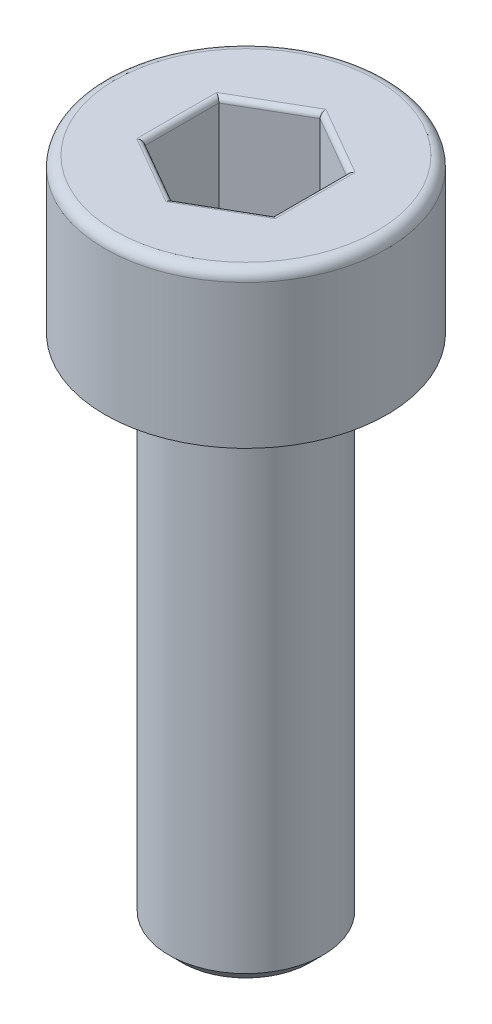
ISO-10303-21;
HEADER;
FILE_DESCRIPTION(('STEP AP214'),'2;1');
FILE_NAME('part.step','',(''),(''),'','','');
FILE_SCHEMA(('AUTOMOTIVE_DESIGN { 1 0 10303 214 1 1 1 1 }'));
ENDSEC;
DATA;
#1=APPLICATION_CONTEXT('core data for automotive mechanical design processes');
#2=APPLICATION_PROTOCOL_DEFINITION('international standard','automotive_design',2000,#1);
#3=PRODUCT_CONTEXT('',#1,'mechanical');
#4=PRODUCT('Part','Part','',(#3));
#5=PRODUCT_RELATED_PRODUCT_CATEGORY('part','',(#4));
#6=PRODUCT_DEFINITION_FORMATION('','',#4);
#7=PRODUCT_DEFINITION_CONTEXT('part definition',#1,'design');
#8=PRODUCT_DEFINITION('design','',#6,#7);
#9=PRODUCT_DEFINITION_SHAPE('','',#8);
#10=(LENGTH_UNIT() NAMED_UNIT(*) SI_UNIT(.MILLI.,.METRE.));
#11=(NAMED_UNIT(*) PLANE_ANGLE_UNIT() SI_UNIT($,.RADIAN.));
#12=(NAMED_UNIT(*) SI_UNIT($,.STERADIAN.) SOLID_ANGLE_UNIT());
#13=UNCERTAINTY_MEASURE_WITH_UNIT(LENGTH_MEASURE(1.E-05),#10,'distance_accuracy_value','');
#14=(GEOMETRIC_REPRESENTATION_CONTEXT(3) GLOBAL_UNCERTAINTY_ASSIGNED_CONTEXT((#13)) GLOBAL_UNIT_ASSIGNED_CONTEXT((#10,
#11,#12)) REPRESENTATION_CONTEXT('',''));
#15=CARTESIAN_POINT('',(0.,0.,0.));
#16=DIRECTION('',(0.,0.,1.));
#17=DIRECTION('',(1.,0.,0.));
#18=AXIS2_PLACEMENT_3D('',#15,#16,#17);
#19=CARTESIAN_POINT('',(0.,-13.,0.));
#20=DIRECTION('',(0.,-1.,0.));
#21=DIRECTION('',(0.,0.,-1.));
#22=AXIS2_PLACEMENT_3D('',#19,#20,#21);
#23=PLANE('',#22);
#24=CARTESIAN_POINT('',(0.,-13.,0.));
#25=DIRECTION('',(0.,-1.,0.));
#26=DIRECTION('',(0.,0.,-1.));
#27=AXIS2_PLACEMENT_3D('',#24,#25,#26);
#28=CIRCLE('',#27,1.25);
#29=CARTESIAN_POINT('',(0.,-13.,-1.25));
#30=VERTEX_POINT('',#29);
#31=EDGE_CURVE('E263',#30,#30,#28,.T.);
#32=ORIENTED_EDGE('',*,*,#31,.T.);
#33=EDGE_LOOP('',(#32));
#34=FACE_BOUND('',#33,.T.);
#35=ADVANCED_FACE('F35',(#34),#23,.T.);
#36=CARTESIAN_POINT('',(0.,0.,0.));
#37=DIRECTION('',(0.,1.,0.));
#38=DIRECTION('',(0.,0.,1.));
#39=AXIS2_PLACEMENT_3D('',#36,#37,#38);
#40=CYLINDRICAL_SURFACE('',#39,1.5);
#41=CARTESIAN_POINT('',(0.,-3.25,0.));
#42=DIRECTION('',(0.,-1.,0.));
#43=DIRECTION('',(0.,0.,-1.));
#44=AXIS2_PLACEMENT_3D('',#41,#42,#43);
#45=CIRCLE('',#44,1.5);
#46=CARTESIAN_POINT('',(0.,-3.25,-1.5));
#47=VERTEX_POINT('',#46);
#48=EDGE_CURVE('E260',#47,#47,#45,.T.);
#49=ORIENTED_EDGE('',*,*,#48,.T.);
#50=EDGE_LOOP('',(#49));
#51=FACE_BOUND('',#50,.T.);
#52=CARTESIAN_POINT('',(0.,-12.75,0.));
#53=DIRECTION('',(0.,-1.,0.));
#54=DIRECTION('',(0.,0.,-1.));
#55=AXIS2_PLACEMENT_3D('',#52,#53,#54);
#56=CIRCLE('',#55,1.5);
#57=CARTESIAN_POINT('',(0.,-12.75,-1.5));
#58=VERTEX_POINT('',#57);
#59=EDGE_CURVE('E257',#58,#58,#56,.F.);
#60=ORIENTED_EDGE('',*,*,#59,.T.);
#61=EDGE_LOOP('',(#60));
#62=FACE_BOUND('',#61,.T.);
#63=ADVANCED_FACE('F289',(#51,#62),#40,.T.);
#64=CARTESIAN_POINT('',(-1.5,-3.,0.));
#65=DIRECTION('',(0.,-1.,0.));
#66=DIRECTION('',(0.,0.,-1.));
#67=AXIS2_PLACEMENT_3D('',#64,#65,#66);
#68=PLANE('',#67);
#69=CARTESIAN_POINT('',(0.,-3.,0.));
#70=DIRECTION('',(0.,-1.,0.));
#71=DIRECTION('',(0.,0.,-1.));
#72=AXIS2_PLACEMENT_3D('',#69,#70,#71);
#73=CIRCLE('',#72,1.75);
#74=CARTESIAN_POINT('',(0.,-3.,-1.75));
#75=VERTEX_POINT('',#74);
#76=EDGE_CURVE('E254',#75,#75,#73,.F.);
#77=ORIENTED_EDGE('',*,*,#76,.T.);
#78=EDGE_LOOP('',(#77));
#79=FACE_BOUND('',#78,.T.);
#80=CARTESIAN_POINT('',(0.,-3.,0.));
#81=DIRECTION('',(0.,1.,0.));
#82=DIRECTION('',(0.,0.,1.));
#83=AXIS2_PLACEMENT_3D('',#80,#81,#82);
#84=CIRCLE('',#83,2.75);
#85=CARTESIAN_POINT('',(0.,-3.,2.75));
#86=VERTEX_POINT('',#85);
#87=EDGE_CURVE('E251',#86,#86,#84,.T.);
#88=ORIENTED_EDGE('',*,*,#87,.F.);
#89=EDGE_LOOP('',(#88));
#90=FACE_BOUND('',#89,.T.);
#91=ADVANCED_FACE('F295',(#79,#90),#68,.T.);
#92=CARTESIAN_POINT('',(0.,0.,0.));
#93=DIRECTION('',(0.,1.,0.));
#94=DIRECTION('',(0.,0.,1.));
#95=AXIS2_PLACEMENT_3D('',#92,#93,#94);
#96=CYLINDRICAL_SURFACE('',#95,2.75);
#97=CARTESIAN_POINT('',(0.,-0.2,0.));
#98=DIRECTION('',(0.,1.,0.));
#99=DIRECTION('',(0.,0.,1.));
#100=AXIS2_PLACEMENT_3D('',#97,#98,#99);
#101=CIRCLE('',#100,2.75);
#102=CARTESIAN_POINT('',(0.,-0.2,2.75));
#103=VERTEX_POINT('',#102);
#104=EDGE_CURVE('E161',#103,#103,#101,.F.);
#105=ORIENTED_EDGE('',*,*,#104,.T.);
#106=EDGE_LOOP('',(#105));
#107=FACE_BOUND('',#106,.T.);
#108=ORIENTED_EDGE('',*,*,#87,.T.);
#109=EDGE_LOOP('',(#108));
#110=FACE_BOUND('',#109,.T.);
#111=ADVANCED_FACE('F305',(#107,#110),#96,.T.);
#112=CARTESIAN_POINT('',(-2.75,0.,0.));
#113=DIRECTION('',(0.,1.,0.));
#114=DIRECTION('',(0.,0.,1.));
#115=AXIS2_PLACEMENT_3D('',#112,#113,#114);
#116=PLANE('',#115);
#117=DIRECTION('',(0.,0.,1.));
#118=VECTOR('',#117,1.);
#119=CARTESIAN_POINT('',(-1.35,0.,-0.721687836487033));
#120=LINE('',#119,#118);
#121=CARTESIAN_POINT('',(-1.35,0.,0.779422863405995));
#122=VERTEX_POINT('',#121);
#123=CARTESIAN_POINT('',(-1.35,0.,-0.779422863405995));
#124=VERTEX_POINT('',#123);
#125=EDGE_CURVE('E177',#122,#124,#120,.F.);
#126=ORIENTED_EDGE('',*,*,#125,.T.);
#127=DIRECTION('',(-0.866025403784439,0.,0.5));
#128=VECTOR('',#127,1.);
#129=CARTESIAN_POINT('',(-0.0500000000000002,0.,-1.52997821335251));
#130=LINE('',#129,#128);
#131=CARTESIAN_POINT('',(0.,0.,-1.55884572681199));
#132=VERTEX_POINT('',#131);
#133=EDGE_CURVE('E136',#124,#132,#130,.F.);
#134=ORIENTED_EDGE('',*,*,#133,.T.);
#135=DIRECTION('',(-0.866025403784439,0.,-0.5));
#136=VECTOR('',#135,1.);
#137=CARTESIAN_POINT('',(1.3,0.,-0.808290376865477));
#138=LINE('',#137,#136);
#139=CARTESIAN_POINT('',(1.35,0.,-0.779422863405995));
#140=VERTEX_POINT('',#139);
#141=EDGE_CURVE('E163',#132,#140,#138,.F.);
#142=ORIENTED_EDGE('',*,*,#141,.T.);
#143=DIRECTION('',(0.,0.,-1.));
#144=VECTOR('',#143,1.);
#145=CARTESIAN_POINT('',(1.35,0.,0.721687836487034));
#146=LINE('',#145,#144);
#147=CARTESIAN_POINT('',(1.35,0.,0.779422863405996));
#148=VERTEX_POINT('',#147);
#149=EDGE_CURVE('E171',#140,#148,#146,.F.);
#150=ORIENTED_EDGE('',*,*,#149,.T.);
#151=DIRECTION('',(0.866025403784439,0.,-0.5));
#152=VECTOR('',#151,1.);
#153=CARTESIAN_POINT('',(0.05,0.,1.52997821335251));
#154=LINE('',#153,#152);
#155=CARTESIAN_POINT('',(0.,0.,1.55884572681199));
#156=VERTEX_POINT('',#155);
#157=EDGE_CURVE('E173',#148,#156,#154,.F.);
#158=ORIENTED_EDGE('',*,*,#157,.T.);
#159=DIRECTION('',(0.866025403784438,0.,0.5));
#160=VECTOR('',#159,1.);
#161=CARTESIAN_POINT('',(-1.3,0.,0.808290376865476));
#162=LINE('',#161,#160);
#163=EDGE_CURVE('E175',#156,#122,#162,.F.);
#164=ORIENTED_EDGE('',*,*,#163,.T.);
#165=EDGE_LOOP('',(#126,#134,#142,#150,#158,#164));
#166=FACE_BOUND('',#165,.T.);
#167=CARTESIAN_POINT('',(0.,0.,0.));
#168=DIRECTION('',(0.,1.,0.));
#169=DIRECTION('',(0.,0.,1.));
#170=AXIS2_PLACEMENT_3D('',#167,#168,#169);
#171=CIRCLE('',#170,2.55);
#172=CARTESIAN_POINT('',(0.,0.,2.55));
#173=VERTEX_POINT('',#172);
#174=EDGE_CURVE('E166',#173,#173,#171,.T.);
#175=ORIENTED_EDGE('',*,*,#174,.T.);
#176=EDGE_LOOP('',(#175));
#177=FACE_BOUND('',#176,.T.);
#178=ADVANCED_FACE('F268',(#166,#177),#116,.T.);
#179=CARTESIAN_POINT('',(0.,-3.,0.));
#180=DIRECTION('',(0.,1.,0.));
#181=DIRECTION('',(0.,0.,1.));
#182=AXIS2_PLACEMENT_3D('',#179,#180,#181);
#183=CONICAL_SURFACE('',#182,1.75,0.785398163397452);
#184=ORIENTED_EDGE('',*,*,#48,.F.);
#185=EDGE_LOOP('',(#184));
#186=FACE_BOUND('',#185,.T.);
#187=ORIENTED_EDGE('',*,*,#76,.F.);
#188=EDGE_LOOP('',(#187));
#189=FACE_BOUND('',#188,.T.);
#190=ADVANCED_FACE('F283',(#186,#189),#183,.T.);
#191=CARTESIAN_POINT('',(0.,-12.75,0.));
#192=DIRECTION('',(0.,1.,0.));
#193=DIRECTION('',(0.,0.,1.));
#194=AXIS2_PLACEMENT_3D('',#191,#192,#193);
#195=CONICAL_SURFACE('',#194,1.5,0.785398163397454);
#196=ORIENTED_EDGE('',*,*,#31,.F.);
#197=EDGE_LOOP('',(#196));
#198=FACE_BOUND('',#197,.T.);
#199=ORIENTED_EDGE('',*,*,#59,.F.);
#200=EDGE_LOOP('',(#199));
#201=FACE_BOUND('',#200,.T.);
#202=ADVANCED_FACE('F273',(#198,#201),#195,.T.);
#203=CARTESIAN_POINT('',(0.,-0.2,0.));
#204=DIRECTION('',(0.,1.,0.));
#205=DIRECTION('',(0.,0.,1.));
#206=AXIS2_PLACEMENT_3D('',#203,#204,#205);
#207=TOROIDAL_SURFACE('',#206,2.55,0.2);
#208=ORIENTED_EDGE('',*,*,#104,.F.);
#209=EDGE_LOOP('',(#208));
#210=FACE_BOUND('',#209,.T.);
#211=ORIENTED_EDGE('',*,*,#174,.F.);
#212=EDGE_LOOP('',(#211));
#213=FACE_BOUND('',#212,.T.);
#214=ADVANCED_FACE('F270',(#210,#213),#207,.T.);
#215=CARTESIAN_POINT('',(1.25,-2.,-0.721687836487033));
#216=DIRECTION('',(0.5,0.,-0.866025403784439));
#217=DIRECTION('',(-0.866025403784439,0.,-0.5));
#218=AXIS2_PLACEMENT_3D('',#215,#216,#217);
#219=PLANE('',#218);
#220=DIRECTION('',(0.,1.,0.));
#221=VECTOR('',#220,1.);
#222=CARTESIAN_POINT('',(1.25,-2.,-0.721687836487033));
#223=LINE('',#222,#221);
#224=CARTESIAN_POINT('',(1.25,-1.9,-0.721687836487033));
#225=VERTEX_POINT('',#224);
#226=CARTESIAN_POINT('',(1.25,-0.1,-0.721687836487033));
#227=VERTEX_POINT('',#226);
#228=EDGE_CURVE('E245',#225,#227,#223,.T.);
#229=ORIENTED_EDGE('',*,*,#228,.T.);
#230=DIRECTION('',(-0.866025403784439,0.,-0.5));
#231=VECTOR('',#230,1.);
#232=CARTESIAN_POINT('',(0.,-0.1,-1.44337567297406));
#233=LINE('',#232,#231);
#234=CARTESIAN_POINT('',(0.,-0.1,-1.44337567297406));
#235=VERTEX_POINT('',#234);
#236=EDGE_CURVE('E197',#227,#235,#233,.T.);
#237=ORIENTED_EDGE('',*,*,#236,.T.);
#238=DIRECTION('',(0.,1.,0.));
#239=VECTOR('',#238,1.);
#240=CARTESIAN_POINT('',(0.,-2.,-1.44337567297406));
#241=LINE('',#240,#239);
#242=CARTESIAN_POINT('',(0.,-1.9,-1.44337567297406));
#243=VERTEX_POINT('',#242);
#244=EDGE_CURVE('E147',#243,#235,#241,.T.);
#245=ORIENTED_EDGE('',*,*,#244,.F.);
#246=DIRECTION('',(-0.866025403784439,0.,-0.5));
#247=VECTOR('',#246,1.);
#248=CARTESIAN_POINT('',(1.25,-1.9,-0.721687836487033));
#249=LINE('',#248,#247);
#250=EDGE_CURVE('E195',#243,#225,#249,.F.);
#251=ORIENTED_EDGE('',*,*,#250,.T.);
#252=EDGE_LOOP('',(#229,#237,#245,#251));
#253=FACE_BOUND('',#252,.T.);
#254=ADVANCED_FACE('F272',(#253),#219,.F.);
#255=CARTESIAN_POINT('',(1.25,-2.,0.721687836487034));
#256=DIRECTION('',(1.,0.,0.));
#257=DIRECTION('',(0.,0.,-1.));
#258=AXIS2_PLACEMENT_3D('',#255,#256,#257);
#259=PLANE('',#258);
#260=DIRECTION('',(0.,1.,0.));
#261=VECTOR('',#260,1.);
#262=CARTESIAN_POINT('',(1.25,-2.,0.721687836487034));
#263=LINE('',#262,#261);
#264=CARTESIAN_POINT('',(1.25,-1.9,0.721687836487034));
#265=VERTEX_POINT('',#264);
#266=CARTESIAN_POINT('',(1.25,-0.1,0.721687836487034));
#267=VERTEX_POINT('',#266);
#268=EDGE_CURVE('E242',#265,#267,#263,.T.);
#269=ORIENTED_EDGE('',*,*,#268,.T.);
#270=DIRECTION('',(0.,0.,-1.));
#271=VECTOR('',#270,1.);
#272=CARTESIAN_POINT('',(1.25,-0.1,-0.721687836487033));
#273=LINE('',#272,#271);
#274=EDGE_CURVE('E193',#267,#227,#273,.T.);
#275=ORIENTED_EDGE('',*,*,#274,.T.);
#276=ORIENTED_EDGE('',*,*,#228,.F.);
#277=DIRECTION('',(0.,0.,-1.));
#278=VECTOR('',#277,1.);
#279=CARTESIAN_POINT('',(1.25,-1.9,0.721687836487034));
#280=LINE('',#279,#278);
#281=EDGE_CURVE('E190',#225,#265,#280,.F.);
#282=ORIENTED_EDGE('',*,*,#281,.T.);
#283=EDGE_LOOP('',(#269,#275,#276,#282));
#284=FACE_BOUND('',#283,.T.);
#285=ADVANCED_FACE('F280',(#284),#259,.F.);
#286=CARTESIAN_POINT('',(0.,-2.,1.44337567297407));
#287=DIRECTION('',(0.5,0.,0.866025403784439));
#288=DIRECTION('',(0.866025403784439,0.,-0.5));
#289=AXIS2_PLACEMENT_3D('',#286,#287,#288);
#290=PLANE('',#289);
#291=DIRECTION('',(0.,1.,0.));
#292=VECTOR('',#291,1.);
#293=CARTESIAN_POINT('',(0.,-2.,1.44337567297407));
#294=LINE('',#293,#292);
#295=CARTESIAN_POINT('',(0.,-1.9,1.44337567297407));
#296=VERTEX_POINT('',#295);
#297=CARTESIAN_POINT('',(0.,-0.1,1.44337567297407));
#298=VERTEX_POINT('',#297);
#299=EDGE_CURVE('E239',#296,#298,#294,.T.);
#300=ORIENTED_EDGE('',*,*,#299,.T.);
#301=DIRECTION('',(0.866025403784439,0.,-0.5));
#302=VECTOR('',#301,1.);
#303=CARTESIAN_POINT('',(1.25,-0.1,0.721687836487034));
#304=LINE('',#303,#302);
#305=EDGE_CURVE('E188',#298,#267,#304,.T.);
#306=ORIENTED_EDGE('',*,*,#305,.T.);
#307=ORIENTED_EDGE('',*,*,#268,.F.);
#308=DIRECTION('',(0.866025403784439,0.,-0.5));
#309=VECTOR('',#308,1.);
#310=CARTESIAN_POINT('',(0.,-1.9,1.44337567297407));
#311=LINE('',#310,#309);
#312=EDGE_CURVE('E186',#265,#296,#311,.F.);
#313=ORIENTED_EDGE('',*,*,#312,.T.);
#314=EDGE_LOOP('',(#300,#306,#307,#313));
#315=FACE_BOUND('',#314,.T.);
#316=ADVANCED_FACE('F329',(#315),#290,.F.);
#317=CARTESIAN_POINT('',(-1.25,-2.,0.721687836487033));
#318=DIRECTION('',(-0.5,0.,0.866025403784439));
#319=DIRECTION('',(0.866025403784438,0.,0.5));
#320=AXIS2_PLACEMENT_3D('',#317,#318,#319);
#321=PLANE('',#320);
#322=DIRECTION('',(0.,1.,0.));
#323=VECTOR('',#322,1.);
#324=CARTESIAN_POINT('',(-1.25,-2.,0.721687836487033));
#325=LINE('',#324,#323);
#326=CARTESIAN_POINT('',(-1.25,-1.9,0.721687836487033));
#327=VERTEX_POINT('',#326);
#328=CARTESIAN_POINT('',(-1.25,-0.1,0.721687836487033));
#329=VERTEX_POINT('',#328);
#330=EDGE_CURVE('E130',#327,#329,#325,.T.);
#331=ORIENTED_EDGE('',*,*,#330,.T.);
#332=DIRECTION('',(0.866025403784438,0.,0.5));
#333=VECTOR('',#332,1.);
#334=CARTESIAN_POINT('',(0.,-0.1,1.44337567297407));
#335=LINE('',#334,#333);
#336=EDGE_CURVE('E184',#329,#298,#335,.T.);
#337=ORIENTED_EDGE('',*,*,#336,.T.);
#338=ORIENTED_EDGE('',*,*,#299,.F.);
#339=DIRECTION('',(0.866025403784438,0.,0.5));
#340=VECTOR('',#339,1.);
#341=CARTESIAN_POINT('',(-1.25,-1.9,0.721687836487033));
#342=LINE('',#341,#340);
#343=EDGE_CURVE('E182',#296,#327,#342,.F.);
#344=ORIENTED_EDGE('',*,*,#343,.T.);
#345=EDGE_LOOP('',(#331,#337,#338,#344));
#346=FACE_BOUND('',#345,.T.);
#347=ADVANCED_FACE('F236',(#346),#321,.F.);
#348=CARTESIAN_POINT('',(-1.25,-2.,-0.721687836487033));
#349=DIRECTION('',(-1.,0.,0.));
#350=DIRECTION('',(0.,0.,1.));
#351=AXIS2_PLACEMENT_3D('',#348,#349,#350);
#352=PLANE('',#351);
#353=DIRECTION('',(0.,1.,0.));
#354=VECTOR('',#353,1.);
#355=CARTESIAN_POINT('',(-1.25,-2.,-0.721687836487033));
#356=LINE('',#355,#354);
#357=CARTESIAN_POINT('',(-1.25,-1.9,-0.721687836487033));
#358=VERTEX_POINT('',#357);
#359=CARTESIAN_POINT('',(-1.25,-0.1,-0.721687836487033));
#360=VERTEX_POINT('',#359);
#361=EDGE_CURVE('E128',#358,#360,#356,.T.);
#362=ORIENTED_EDGE('',*,*,#361,.T.);
#363=DIRECTION('',(0.,0.,1.));
#364=VECTOR('',#363,1.);
#365=CARTESIAN_POINT('',(-1.25,-0.1,0.721687836487033));
#366=LINE('',#365,#364);
#367=EDGE_CURVE('E135',#360,#329,#366,.T.);
#368=ORIENTED_EDGE('',*,*,#367,.T.);
#369=ORIENTED_EDGE('',*,*,#330,.F.);
#370=DIRECTION('',(0.,0.,1.));
#371=VECTOR('',#370,1.);
#372=CARTESIAN_POINT('',(-1.25,-1.9,-0.721687836487033));
#373=LINE('',#372,#371);
#374=EDGE_CURVE('E125',#327,#358,#373,.F.);
#375=ORIENTED_EDGE('',*,*,#374,.T.);
#376=EDGE_LOOP('',(#362,#368,#369,#375));
#377=FACE_BOUND('',#376,.T.);
#378=ADVANCED_FACE('F127',(#377),#352,.F.);
#379=CARTESIAN_POINT('',(0.,-2.,-1.44337567297406));
#380=DIRECTION('',(-0.5,0.,-0.866025403784439));
#381=DIRECTION('',(-0.866025403784439,0.,0.5));
#382=AXIS2_PLACEMENT_3D('',#379,#380,#381);
#383=PLANE('',#382);
#384=ORIENTED_EDGE('',*,*,#244,.T.);
#385=DIRECTION('',(-0.866025403784439,0.,0.5));
#386=VECTOR('',#385,1.);
#387=CARTESIAN_POINT('',(-1.25,-0.1,-0.721687836487032));
#388=LINE('',#387,#386);
#389=EDGE_CURVE('E146',#235,#360,#388,.T.);
#390=ORIENTED_EDGE('',*,*,#389,.T.);
#391=ORIENTED_EDGE('',*,*,#361,.F.);
#392=DIRECTION('',(-0.866025403784439,0.,0.5));
#393=VECTOR('',#392,1.);
#394=CARTESIAN_POINT('',(0.,-1.9,-1.44337567297406));
#395=LINE('',#394,#393);
#396=EDGE_CURVE('E143',#358,#243,#395,.F.);
#397=ORIENTED_EDGE('',*,*,#396,.T.);
#398=EDGE_LOOP('',(#384,#390,#391,#397));
#399=FACE_BOUND('',#398,.T.);
#400=ADVANCED_FACE('F141',(#399),#383,.F.);
#401=CARTESIAN_POINT('',(1.25,-2.,-0.721687836487033));
#402=DIRECTION('',(0.,-1.,0.));
#403=DIRECTION('',(0.,0.,-1.));
#404=AXIS2_PLACEMENT_3D('',#401,#402,#403);
#405=PLANE('',#404);
#406=DIRECTION('',(0.866025403784439,0.,-0.5));
#407=VECTOR('',#406,1.);
#408=CARTESIAN_POINT('',(1.2,-2.,0.63508529610859));
#409=LINE('',#408,#407);
#410=CARTESIAN_POINT('',(0.,-2.,1.32790561913614));
#411=VERTEX_POINT('',#410);
#412=CARTESIAN_POINT('',(1.15,-2.,0.663952809568071));
#413=VERTEX_POINT('',#412);
#414=EDGE_CURVE('E44',#411,#413,#409,.T.);
#415=ORIENTED_EDGE('',*,*,#414,.T.);
#416=DIRECTION('',(0.,0.,-1.));
#417=VECTOR('',#416,1.);
#418=CARTESIAN_POINT('',(1.15,-2.,-0.721687836487033));
#419=LINE('',#418,#417);
#420=CARTESIAN_POINT('',(1.15,-2.,-0.66395280956807));
#421=VERTEX_POINT('',#420);
#422=EDGE_CURVE('E11',#413,#421,#419,.T.);
#423=ORIENTED_EDGE('',*,*,#422,.T.);
#424=DIRECTION('',(-0.866025403784439,0.,-0.5));
#425=VECTOR('',#424,1.);
#426=CARTESIAN_POINT('',(-0.0500000000000001,-2.,-1.35677313259562));
#427=LINE('',#426,#425);
#428=CARTESIAN_POINT('',(0.,-2.,-1.32790561913614));
#429=VERTEX_POINT('',#428);
#430=EDGE_CURVE('E199',#421,#429,#427,.T.);
#431=ORIENTED_EDGE('',*,*,#430,.T.);
#432=DIRECTION('',(-0.866025403784439,0.,0.5));
#433=VECTOR('',#432,1.);
#434=CARTESIAN_POINT('',(-1.2,-2.,-0.635085296108588));
#435=LINE('',#434,#433);
#436=CARTESIAN_POINT('',(-1.15,-2.,-0.66395280956807));
#437=VERTEX_POINT('',#436);
#438=EDGE_CURVE('E201',#429,#437,#435,.T.);
#439=ORIENTED_EDGE('',*,*,#438,.T.);
#440=DIRECTION('',(0.,0.,1.));
#441=VECTOR('',#440,1.);
#442=CARTESIAN_POINT('',(-1.15,-2.,0.721687836487033));
#443=LINE('',#442,#441);
#444=CARTESIAN_POINT('',(-1.15,-2.,0.66395280956807));
#445=VERTEX_POINT('',#444);
#446=EDGE_CURVE('E152',#437,#445,#443,.T.);
#447=ORIENTED_EDGE('',*,*,#446,.T.);
#448=DIRECTION('',(0.866025403784438,0.,0.5));
#449=VECTOR('',#448,1.);
#450=CARTESIAN_POINT('',(0.0499999999999999,-2.,1.35677313259562));
#451=LINE('',#450,#449);
#452=EDGE_CURVE('E55',#445,#411,#451,.T.);
#453=ORIENTED_EDGE('',*,*,#452,.T.);
#454=EDGE_LOOP('',(#415,#423,#431,#439,#447,#453));
#455=FACE_BOUND('',#454,.T.);
#456=ADVANCED_FACE('F324',(#455),#405,.F.);
#457=CARTESIAN_POINT('',(0.05,-0.1,1.52997821335251));
#458=DIRECTION('',(-0.866025403784439,0.,0.5));
#459=DIRECTION('',(0.5,0.,0.866025403784439));
#460=AXIS2_PLACEMENT_3D('',#457,#458,#459);
#461=CYLINDRICAL_SURFACE('',#460,0.1);
#462=CARTESIAN_POINT('',(0.,-0.1,1.55884572681199));
#463=DIRECTION('',(-1.,0.,0.));
#464=DIRECTION('',(0.,0.,-1.));
#465=AXIS2_PLACEMENT_3D('',#462,#463,#464);
#466=ELLIPSE('',#465,0.115470053837925,0.1);
#467=EDGE_CURVE('E216',#156,#298,#466,.T.);
#468=ORIENTED_EDGE('',*,*,#467,.F.);
#469=ORIENTED_EDGE('',*,*,#157,.F.);
#470=CARTESIAN_POINT('',(1.35,-0.1,0.779422863405997));
#471=DIRECTION('',(-0.5,0.,0.866025403784438));
#472=DIRECTION('',(-0.866025403784438,0.,-0.5));
#473=AXIS2_PLACEMENT_3D('',#470,#471,#472);
#474=ELLIPSE('',#473,0.115470053837925,0.1);
#475=EDGE_CURVE('E219',#267,#148,#474,.F.);
#476=ORIENTED_EDGE('',*,*,#475,.F.);
#477=ORIENTED_EDGE('',*,*,#305,.F.);
#478=EDGE_LOOP('',(#468,#469,#476,#477));
#479=FACE_BOUND('',#478,.T.);
#480=ADVANCED_FACE('F336',(#479),#461,.T.);
#481=CARTESIAN_POINT('',(1.35,-0.1,0.721687836487034));
#482=DIRECTION('',(0.,0.,1.));
#483=DIRECTION('',(1.,0.,0.));
#484=AXIS2_PLACEMENT_3D('',#481,#482,#483);
#485=CYLINDRICAL_SURFACE('',#484,0.1);
#486=ORIENTED_EDGE('',*,*,#475,.T.);
#487=ORIENTED_EDGE('',*,*,#149,.F.);
#488=CARTESIAN_POINT('',(1.35,-0.1,-0.779422863405995));
#489=DIRECTION('',(0.5,0.,0.866025403784439));
#490=DIRECTION('',(-0.866025403784439,0.,0.5));
#491=AXIS2_PLACEMENT_3D('',#488,#489,#490);
#492=ELLIPSE('',#491,0.115470053837925,0.1);
#493=EDGE_CURVE('E213',#227,#140,#492,.F.);
#494=ORIENTED_EDGE('',*,*,#493,.F.);
#495=ORIENTED_EDGE('',*,*,#274,.F.);
#496=EDGE_LOOP('',(#486,#487,#494,#495));
#497=FACE_BOUND('',#496,.T.);
#498=ADVANCED_FACE('F340',(#497),#485,.T.);
#499=CARTESIAN_POINT('',(-1.3,-0.1,0.808290376865476));
#500=DIRECTION('',(-0.866025403784438,0.,-0.5));
#501=DIRECTION('',(-0.5,0.,0.866025403784439));
#502=AXIS2_PLACEMENT_3D('',#499,#500,#501);
#503=CYLINDRICAL_SURFACE('',#502,0.1);
#504=ORIENTED_EDGE('',*,*,#467,.T.);
#505=ORIENTED_EDGE('',*,*,#336,.F.);
#506=CARTESIAN_POINT('',(-1.35,-0.1,0.779422863405995));
#507=DIRECTION('',(-0.5,0.,-0.866025403784439));
#508=DIRECTION('',(0.866025403784439,0.,-0.5));
#509=AXIS2_PLACEMENT_3D('',#506,#507,#508);
#510=ELLIPSE('',#509,0.115470053837925,0.1);
#511=EDGE_CURVE('E210',#122,#329,#510,.T.);
#512=ORIENTED_EDGE('',*,*,#511,.F.);
#513=ORIENTED_EDGE('',*,*,#163,.F.);
#514=EDGE_LOOP('',(#504,#505,#512,#513));
#515=FACE_BOUND('',#514,.T.);
#516=ADVANCED_FACE('F346',(#515),#503,.T.);
#517=CARTESIAN_POINT('',(1.3,-0.1,-0.808290376865477));
#518=DIRECTION('',(0.866025403784439,0.,0.5));
#519=DIRECTION('',(0.5,0.,-0.866025403784439));
#520=AXIS2_PLACEMENT_3D('',#517,#518,#519);
#521=CYLINDRICAL_SURFACE('',#520,0.1);
#522=ORIENTED_EDGE('',*,*,#493,.T.);
#523=ORIENTED_EDGE('',*,*,#141,.F.);
#524=CARTESIAN_POINT('',(0.,-0.1,-1.55884572681199));
#525=DIRECTION('',(1.,0.,0.));
#526=DIRECTION('',(0.,0.,-1.));
#527=AXIS2_PLACEMENT_3D('',#524,#525,#526);
#528=ELLIPSE('',#527,0.115470053837925,0.1);
#529=EDGE_CURVE('E208',#235,#132,#528,.F.);
#530=ORIENTED_EDGE('',*,*,#529,.F.);
#531=ORIENTED_EDGE('',*,*,#236,.F.);
#532=EDGE_LOOP('',(#522,#523,#530,#531));
#533=FACE_BOUND('',#532,.T.);
#534=ADVANCED_FACE('F376',(#533),#521,.T.);
#535=CARTESIAN_POINT('',(-1.35,-0.1,-0.721687836487033));
#536=DIRECTION('',(0.,0.,-1.));
#537=DIRECTION('',(-1.,0.,0.));
#538=AXIS2_PLACEMENT_3D('',#535,#536,#537);
#539=CYLINDRICAL_SURFACE('',#538,0.1);
#540=ORIENTED_EDGE('',*,*,#511,.T.);
#541=ORIENTED_EDGE('',*,*,#367,.F.);
#542=CARTESIAN_POINT('',(-1.35,-0.1,-0.779422863405995));
#543=DIRECTION('',(0.5,0.,-0.866025403784439));
#544=DIRECTION('',(0.866025403784439,0.,0.5));
#545=AXIS2_PLACEMENT_3D('',#542,#543,#544);
#546=ELLIPSE('',#545,0.115470053837925,0.1);
#547=EDGE_CURVE('E206',#124,#360,#546,.T.);
#548=ORIENTED_EDGE('',*,*,#547,.F.);
#549=ORIENTED_EDGE('',*,*,#125,.F.);
#550=EDGE_LOOP('',(#540,#541,#548,#549));
#551=FACE_BOUND('',#550,.T.);
#552=ADVANCED_FACE('F371',(#551),#539,.T.);
#553=CARTESIAN_POINT('',(-0.05,-0.1,-1.52997821335251));
#554=DIRECTION('',(0.866025403784439,0.,-0.5));
#555=DIRECTION('',(-0.5,0.,-0.866025403784439));
#556=AXIS2_PLACEMENT_3D('',#553,#554,#555);
#557=CYLINDRICAL_SURFACE('',#556,0.1);
#558=ORIENTED_EDGE('',*,*,#529,.T.);
#559=ORIENTED_EDGE('',*,*,#133,.F.);
#560=ORIENTED_EDGE('',*,*,#547,.T.);
#561=ORIENTED_EDGE('',*,*,#389,.F.);
#562=EDGE_LOOP('',(#558,#559,#560,#561));
#563=FACE_BOUND('',#562,.T.);
#564=ADVANCED_FACE('F367',(#563),#557,.T.);
#565=CARTESIAN_POINT('',(-1.15,-1.9,-0.721687836487033));
#566=DIRECTION('',(0.,0.,-1.));
#567=DIRECTION('',(-1.,0.,0.));
#568=AXIS2_PLACEMENT_3D('',#565,#566,#567);
#569=CYLINDRICAL_SURFACE('',#568,0.1);
#570=CARTESIAN_POINT('',(-1.15,-1.9,-0.663952809568069));
#571=DIRECTION('',(0.5,0.,-0.866025403784439));
#572=DIRECTION('',(-0.866025403784439,0.,-0.5));
#573=AXIS2_PLACEMENT_3D('',#570,#571,#572);
#574=ELLIPSE('',#573,0.115470053837925,0.1);
#575=EDGE_CURVE('E151',#358,#437,#574,.F.);
#576=ORIENTED_EDGE('',*,*,#575,.F.);
#577=ORIENTED_EDGE('',*,*,#374,.F.);
#578=CARTESIAN_POINT('',(-1.15,-1.9,0.66395280956807));
#579=DIRECTION('',(-0.5,0.,-0.866025403784439));
#580=DIRECTION('',(-0.866025403784439,0.,0.5));
#581=AXIS2_PLACEMENT_3D('',#578,#579,#580);
#582=ELLIPSE('',#581,0.115470053837925,0.1);
#583=EDGE_CURVE('E39',#445,#327,#582,.T.);
#584=ORIENTED_EDGE('',*,*,#583,.F.);
#585=ORIENTED_EDGE('',*,*,#446,.F.);
#586=EDGE_LOOP('',(#576,#577,#584,#585));
#587=FACE_BOUND('',#586,.T.);
#588=ADVANCED_FACE('F37',(#587),#569,.F.);
#589=CARTESIAN_POINT('',(0.0499999999999988,-1.9,1.35677313259562));
#590=DIRECTION('',(-0.866025403784438,0.,-0.5));
#591=DIRECTION('',(-0.5,0.,0.866025403784439));
#592=AXIS2_PLACEMENT_3D('',#589,#590,#591);
#593=CYLINDRICAL_SURFACE('',#592,0.1);
#594=ORIENTED_EDGE('',*,*,#583,.T.);
#595=ORIENTED_EDGE('',*,*,#343,.F.);
#596=CARTESIAN_POINT('',(0.,-1.9,1.32790561913614));
#597=DIRECTION('',(-1.,0.,0.));
#598=DIRECTION('',(0.,0.,1.));
#599=AXIS2_PLACEMENT_3D('',#596,#597,#598);
#600=ELLIPSE('',#599,0.115470053837925,0.1);
#601=EDGE_CURVE('E155',#411,#296,#600,.T.);
#602=ORIENTED_EDGE('',*,*,#601,.F.);
#603=ORIENTED_EDGE('',*,*,#452,.F.);
#604=EDGE_LOOP('',(#594,#595,#602,#603));
#605=FACE_BOUND('',#604,.T.);
#606=ADVANCED_FACE('F233',(#605),#593,.F.);
#607=CARTESIAN_POINT('',(0.675,-1.9,-1.71761705083914));
#608=DIRECTION('',(0.866025403784439,0.,-0.5));
#609=DIRECTION('',(-0.5,0.,-0.866025403784439));
#610=AXIS2_PLACEMENT_3D('',#607,#608,#609);
#611=CYLINDRICAL_SURFACE('',#610,0.1);
#612=ORIENTED_EDGE('',*,*,#575,.T.);
#613=ORIENTED_EDGE('',*,*,#438,.F.);
#614=CARTESIAN_POINT('',(0.,-1.9,-1.32790561913614));
#615=DIRECTION('',(1.,0.,0.));
#616=DIRECTION('',(0.,0.,-1.));
#617=AXIS2_PLACEMENT_3D('',#614,#615,#616);
#618=ELLIPSE('',#617,0.115470053837925,0.1);
#619=EDGE_CURVE('E159',#243,#429,#618,.F.);
#620=ORIENTED_EDGE('',*,*,#619,.F.);
#621=ORIENTED_EDGE('',*,*,#396,.F.);
#622=EDGE_LOOP('',(#612,#613,#620,#621));
#623=FACE_BOUND('',#622,.T.);
#624=ADVANCED_FACE('F157',(#623),#611,.F.);
#625=CARTESIAN_POINT('',(1.825,-1.9,0.274241377865074));
#626=DIRECTION('',(-0.866025403784439,0.,0.5));
#627=DIRECTION('',(0.5,0.,0.866025403784439));
#628=AXIS2_PLACEMENT_3D('',#625,#626,#627);
#629=CYLINDRICAL_SURFACE('',#628,0.1);
#630=ORIENTED_EDGE('',*,*,#601,.T.);
#631=ORIENTED_EDGE('',*,*,#312,.F.);
#632=CARTESIAN_POINT('',(1.15,-1.9,0.663952809568072));
#633=DIRECTION('',(-0.5,0.,0.866025403784438));
#634=DIRECTION('',(0.866025403784438,0.,0.5));
#635=AXIS2_PLACEMENT_3D('',#632,#633,#634);
#636=ELLIPSE('',#635,0.115470053837925,0.1);
#637=EDGE_CURVE('E224',#413,#265,#636,.T.);
#638=ORIENTED_EDGE('',*,*,#637,.F.);
#639=ORIENTED_EDGE('',*,*,#414,.F.);
#640=EDGE_LOOP('',(#630,#631,#638,#639));
#641=FACE_BOUND('',#640,.T.);
#642=ADVANCED_FACE('F230',(#641),#629,.F.);
#643=CARTESIAN_POINT('',(1.2,-1.9,-0.635085296108589));
#644=DIRECTION('',(0.866025403784439,0.,0.5));
#645=DIRECTION('',(0.5,0.,-0.866025403784439));
#646=AXIS2_PLACEMENT_3D('',#643,#644,#645);
#647=CYLINDRICAL_SURFACE('',#646,0.1);
#648=ORIENTED_EDGE('',*,*,#619,.T.);
#649=ORIENTED_EDGE('',*,*,#430,.F.);
#650=CARTESIAN_POINT('',(1.15,-1.9,-0.66395280956807));
#651=DIRECTION('',(0.5,0.,0.866025403784439));
#652=DIRECTION('',(-0.866025403784439,0.,0.5));
#653=AXIS2_PLACEMENT_3D('',#650,#651,#652);
#654=ELLIPSE('',#653,0.115470053837925,0.1);
#655=EDGE_CURVE('E222',#225,#421,#654,.F.);
#656=ORIENTED_EDGE('',*,*,#655,.F.);
#657=ORIENTED_EDGE('',*,*,#250,.F.);
#658=EDGE_LOOP('',(#648,#649,#656,#657));
#659=FACE_BOUND('',#658,.T.);
#660=ADVANCED_FACE('F355',(#659),#647,.F.);
#661=CARTESIAN_POINT('',(1.15,-1.9,-0.721687836487033));
#662=DIRECTION('',(0.,0.,1.));
#663=DIRECTION('',(1.,0.,0.));
#664=AXIS2_PLACEMENT_3D('',#661,#662,#663);
#665=CYLINDRICAL_SURFACE('',#664,0.1);
#666=ORIENTED_EDGE('',*,*,#637,.T.);
#667=ORIENTED_EDGE('',*,*,#281,.F.);
#668=ORIENTED_EDGE('',*,*,#655,.T.);
#669=ORIENTED_EDGE('',*,*,#422,.F.);
#670=EDGE_LOOP('',(#666,#667,#668,#669));
#671=FACE_BOUND('',#670,.T.);
#672=ADVANCED_FACE('F352',(#671),#665,.F.);
#673=CLOSED_SHELL('',(#35,#63,#91,#111,#178,#190,#202,#214,#254,#285,#316,#347,#378,#400,#456,
#480,#498,#516,#534,#552,#564,#588,#606,#624,#642,#660,#672));
#674=MANIFOLD_SOLID_BREP('B2',#673);
#675=ADVANCED_BREP_SHAPE_REPRESENTATION('',(#18,#674),#14);
#676=SHAPE_DEFINITION_REPRESENTATION(#9,#675);
ENDSEC;
END-ISO-10303-21;
